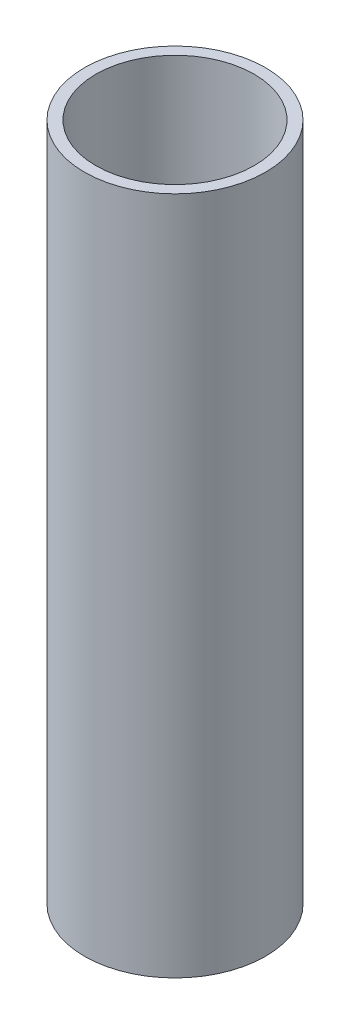
ISO-10303-21;
HEADER;
FILE_DESCRIPTION(('STEP AP214'),'2;1');
FILE_NAME('part.step','',(''),(''),'','','');
FILE_SCHEMA(('AUTOMOTIVE_DESIGN { 1 0 10303 214 1 1 1 1 }'));
ENDSEC;
DATA;
#1=APPLICATION_CONTEXT('core data for automotive mechanical design processes');
#2=APPLICATION_PROTOCOL_DEFINITION('international standard','automotive_design',2000,#1);
#3=PRODUCT_CONTEXT('',#1,'mechanical');
#4=PRODUCT('Part','Part','',(#3));
#5=PRODUCT_RELATED_PRODUCT_CATEGORY('part','',(#4));
#6=PRODUCT_DEFINITION_FORMATION('','',#4);
#7=PRODUCT_DEFINITION_CONTEXT('part definition',#1,'design');
#8=PRODUCT_DEFINITION('design','',#6,#7);
#9=PRODUCT_DEFINITION_SHAPE('','',#8);
#10=(LENGTH_UNIT() NAMED_UNIT(*) SI_UNIT(.MILLI.,.METRE.));
#11=(NAMED_UNIT(*) PLANE_ANGLE_UNIT() SI_UNIT($,.RADIAN.));
#12=(NAMED_UNIT(*) SI_UNIT($,.STERADIAN.) SOLID_ANGLE_UNIT());
#13=UNCERTAINTY_MEASURE_WITH_UNIT(LENGTH_MEASURE(1.E-05),#10,'distance_accuracy_value','');
#14=(GEOMETRIC_REPRESENTATION_CONTEXT(3) GLOBAL_UNCERTAINTY_ASSIGNED_CONTEXT((#13)) GLOBAL_UNIT_ASSIGNED_CONTEXT((#10,
#11,#12)) REPRESENTATION_CONTEXT('',''));
#15=CARTESIAN_POINT('',(0.,0.,0.));
#16=DIRECTION('',(0.,0.,1.));
#17=DIRECTION('',(1.,0.,0.));
#18=AXIS2_PLACEMENT_3D('',#15,#16,#17);
#19=CARTESIAN_POINT('',(0.,60.,0.));
#20=DIRECTION('',(0.,1.,0.));
#21=DIRECTION('',(0.,0.,1.));
#22=AXIS2_PLACEMENT_3D('',#19,#20,#21);
#23=PLANE('',#22);
#24=CARTESIAN_POINT('',(0.,60.,0.));
#25=DIRECTION('',(0.,1.,0.));
#26=DIRECTION('',(0.,0.,1.));
#27=AXIS2_PLACEMENT_3D('',#24,#25,#26);
#28=CIRCLE('',#27,8.);
#29=CARTESIAN_POINT('',(0.,60.,8.));
#30=VERTEX_POINT('',#29);
#31=EDGE_CURVE('E10',#30,#30,#28,.T.);
#32=ORIENTED_EDGE('',*,*,#31,.T.);
#33=EDGE_LOOP('',(#32));
#34=FACE_BOUND('',#33,.T.);
#35=CARTESIAN_POINT('',(0.,60.,0.));
#36=DIRECTION('',(0.,1.,0.));
#37=DIRECTION('',(0.,0.,1.));
#38=AXIS2_PLACEMENT_3D('',#35,#36,#37);
#39=CIRCLE('',#38,7.);
#40=CARTESIAN_POINT('',(0.,60.,7.));
#41=VERTEX_POINT('',#40);
#42=EDGE_CURVE('E47',#41,#41,#39,.T.);
#43=ORIENTED_EDGE('',*,*,#42,.F.);
#44=EDGE_LOOP('',(#43));
#45=FACE_BOUND('',#44,.T.);
#46=ADVANCED_FACE('F36',(#34,#45),#23,.T.);
#47=CARTESIAN_POINT('',(0.,0.,0.));
#48=DIRECTION('',(0.,1.,0.));
#49=DIRECTION('',(0.,0.,1.));
#50=AXIS2_PLACEMENT_3D('',#47,#48,#49);
#51=PLANE('',#50);
#52=CARTESIAN_POINT('',(0.,0.,0.));
#53=DIRECTION('',(0.,1.,0.));
#54=DIRECTION('',(0.,0.,1.));
#55=AXIS2_PLACEMENT_3D('',#52,#53,#54);
#56=CIRCLE('',#55,8.);
#57=CARTESIAN_POINT('',(0.,0.,8.));
#58=VERTEX_POINT('',#57);
#59=EDGE_CURVE('E40',#58,#58,#56,.T.);
#60=ORIENTED_EDGE('',*,*,#59,.F.);
#61=EDGE_LOOP('',(#60));
#62=FACE_BOUND('',#61,.T.);
#63=CARTESIAN_POINT('',(0.,0.,0.));
#64=DIRECTION('',(0.,1.,0.));
#65=DIRECTION('',(0.,0.,1.));
#66=AXIS2_PLACEMENT_3D('',#63,#64,#65);
#67=CIRCLE('',#66,7.);
#68=CARTESIAN_POINT('',(0.,0.,7.));
#69=VERTEX_POINT('',#68);
#70=EDGE_CURVE('E49',#69,#69,#67,.T.);
#71=ORIENTED_EDGE('',*,*,#70,.T.);
#72=EDGE_LOOP('',(#71));
#73=FACE_BOUND('',#72,.T.);
#74=ADVANCED_FACE('F59',(#62,#73),#51,.F.);
#75=CARTESIAN_POINT('',(0.,60.,0.));
#76=DIRECTION('',(0.,-1.,0.));
#77=DIRECTION('',(0.,0.,-1.));
#78=AXIS2_PLACEMENT_3D('',#75,#76,#77);
#79=CYLINDRICAL_SURFACE('',#78,8.);
#80=ORIENTED_EDGE('',*,*,#31,.F.);
#81=EDGE_LOOP('',(#80));
#82=FACE_BOUND('',#81,.T.);
#83=ORIENTED_EDGE('',*,*,#59,.T.);
#84=EDGE_LOOP('',(#83));
#85=FACE_BOUND('',#84,.T.);
#86=ADVANCED_FACE('F38',(#82,#85),#79,.T.);
#87=CARTESIAN_POINT('',(0.,60.,0.));
#88=DIRECTION('',(0.,-1.,0.));
#89=DIRECTION('',(0.,0.,-1.));
#90=AXIS2_PLACEMENT_3D('',#87,#88,#89);
#91=CYLINDRICAL_SURFACE('',#90,7.);
#92=ORIENTED_EDGE('',*,*,#42,.T.);
#93=EDGE_LOOP('',(#92));
#94=FACE_BOUND('',#93,.T.);
#95=ORIENTED_EDGE('',*,*,#70,.F.);
#96=EDGE_LOOP('',(#95));
#97=FACE_BOUND('',#96,.T.);
#98=ADVANCED_FACE('F55',(#94,#97),#91,.F.);
#99=CLOSED_SHELL('',(#46,#74,#86,#98));
#100=MANIFOLD_SOLID_BREP('B2',#99);
#101=ADVANCED_BREP_SHAPE_REPRESENTATION('',(#18,#100),#14);
#102=SHAPE_DEFINITION_REPRESENTATION(#9,#101);
ENDSEC;
END-ISO-10303-21;
